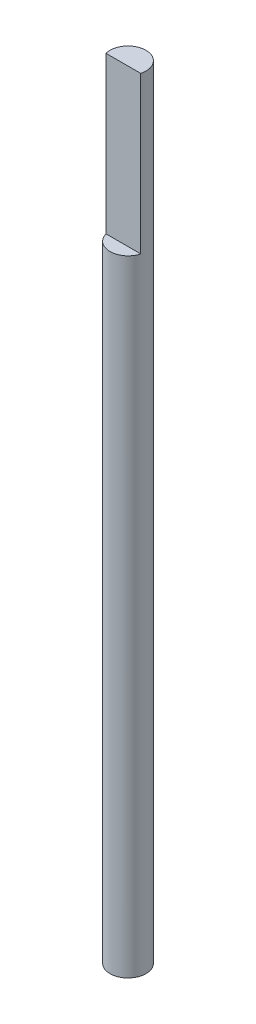
ISO-10303-21;
HEADER;
FILE_DESCRIPTION(('STEP AP214'),'2;1');
FILE_NAME('part.step','',(''),(''),'','','');
FILE_SCHEMA(('AUTOMOTIVE_DESIGN { 1 0 10303 214 1 1 1 1 }'));
ENDSEC;
DATA;
#1=APPLICATION_CONTEXT('core data for automotive mechanical design processes');
#2=APPLICATION_PROTOCOL_DEFINITION('international standard','automotive_design',2000,#1);
#3=PRODUCT_CONTEXT('',#1,'mechanical');
#4=PRODUCT('Part','Part','',(#3));
#5=PRODUCT_RELATED_PRODUCT_CATEGORY('part','',(#4));
#6=PRODUCT_DEFINITION_FORMATION('','',#4);
#7=PRODUCT_DEFINITION_CONTEXT('part definition',#1,'design');
#8=PRODUCT_DEFINITION('design','',#6,#7);
#9=PRODUCT_DEFINITION_SHAPE('','',#8);
#10=(LENGTH_UNIT() NAMED_UNIT(*) SI_UNIT(.MILLI.,.METRE.));
#11=(NAMED_UNIT(*) PLANE_ANGLE_UNIT() SI_UNIT($,.RADIAN.));
#12=(NAMED_UNIT(*) SI_UNIT($,.STERADIAN.) SOLID_ANGLE_UNIT());
#13=UNCERTAINTY_MEASURE_WITH_UNIT(LENGTH_MEASURE(1.E-05),#10,'distance_accuracy_value','');
#14=(GEOMETRIC_REPRESENTATION_CONTEXT(3) GLOBAL_UNCERTAINTY_ASSIGNED_CONTEXT((#13)) GLOBAL_UNIT_ASSIGNED_CONTEXT((#10,
#11,#12)) REPRESENTATION_CONTEXT('',''));
#15=CARTESIAN_POINT('',(0.,0.,0.));
#16=DIRECTION('',(0.,0.,1.));
#17=DIRECTION('',(1.,0.,0.));
#18=AXIS2_PLACEMENT_3D('',#15,#16,#17);
#19=CARTESIAN_POINT('',(0.,127.,0.));
#20=DIRECTION('',(0.,-1.,0.));
#21=DIRECTION('',(0.,0.,-1.));
#22=AXIS2_PLACEMENT_3D('',#19,#20,#21);
#23=CYLINDRICAL_SURFACE('',#22,2.921);
#24=CARTESIAN_POINT('',(0.,127.,0.));
#25=DIRECTION('',(0.,1.,0.));
#26=DIRECTION('',(0.,0.,1.));
#27=AXIS2_PLACEMENT_3D('',#24,#25,#26);
#28=CIRCLE('',#27,2.921);
#29=CARTESIAN_POINT('',(2.82198479502472,127.,0.754084091232057));
#30=VERTEX_POINT('',#29);
#31=CARTESIAN_POINT('',(-2.82198479502472,127.,0.754084091232057));
#32=VERTEX_POINT('',#31);
#33=EDGE_CURVE('E70',#30,#32,#28,.T.);
#34=ORIENTED_EDGE('',*,*,#33,.F.);
#35=DIRECTION('',(0.,-1.,0.));
#36=VECTOR('',#35,1.);
#37=CARTESIAN_POINT('',(2.82198479502472,127.,0.754084091232057));
#38=LINE('',#37,#36);
#39=CARTESIAN_POINT('',(2.82198479502472,101.6,0.754084091232057));
#40=VERTEX_POINT('',#39);
#41=EDGE_CURVE('E53',#30,#40,#38,.T.);
#42=ORIENTED_EDGE('',*,*,#41,.T.);
#43=CARTESIAN_POINT('',(0.,101.6,0.));
#44=DIRECTION('',(0.,1.,0.));
#45=DIRECTION('',(0.,0.,1.));
#46=AXIS2_PLACEMENT_3D('',#43,#44,#45);
#47=CIRCLE('',#46,2.921);
#48=CARTESIAN_POINT('',(-2.82198479502472,101.6,0.754084091232057));
#49=VERTEX_POINT('',#48);
#50=EDGE_CURVE('E11',#49,#40,#47,.T.);
#51=ORIENTED_EDGE('',*,*,#50,.F.);
#52=DIRECTION('',(0.,1.,0.));
#53=VECTOR('',#52,1.);
#54=CARTESIAN_POINT('',(-2.82198479502472,101.6,0.754084091232057));
#55=LINE('',#54,#53);
#56=EDGE_CURVE('E65',#49,#32,#55,.T.);
#57=ORIENTED_EDGE('',*,*,#56,.T.);
#58=EDGE_LOOP('',(#34,#42,#51,#57));
#59=FACE_BOUND('',#58,.T.);
#60=CARTESIAN_POINT('',(0.,0.,0.));
#61=DIRECTION('',(0.,1.,0.));
#62=DIRECTION('',(0.,0.,1.));
#63=AXIS2_PLACEMENT_3D('',#60,#61,#62);
#64=CIRCLE('',#63,2.921);
#65=CARTESIAN_POINT('',(0.,0.,2.921));
#66=VERTEX_POINT('',#65);
#67=EDGE_CURVE('E78',#66,#66,#64,.T.);
#68=ORIENTED_EDGE('',*,*,#67,.T.);
#69=EDGE_LOOP('',(#68));
#70=FACE_BOUND('',#69,.T.);
#71=ADVANCED_FACE('F38',(#59,#70),#23,.T.);
#72=CARTESIAN_POINT('',(0.,127.,0.));
#73=DIRECTION('',(0.,1.,0.));
#74=DIRECTION('',(0.,0.,1.));
#75=AXIS2_PLACEMENT_3D('',#72,#73,#74);
#76=PLANE('',#75);
#77=DIRECTION('',(-1.,0.,0.));
#78=VECTOR('',#77,1.);
#79=CARTESIAN_POINT('',(0.,127.,0.754084091232057));
#80=LINE('',#79,#78);
#81=EDGE_CURVE('E46',#30,#32,#80,.T.);
#82=ORIENTED_EDGE('',*,*,#81,.F.);
#83=ORIENTED_EDGE('',*,*,#33,.T.);
#84=EDGE_LOOP('',(#82,#83));
#85=FACE_BOUND('',#84,.T.);
#86=ADVANCED_FACE('F76',(#85),#76,.T.);
#87=CARTESIAN_POINT('',(0.,0.,0.));
#88=DIRECTION('',(0.,1.,0.));
#89=DIRECTION('',(0.,0.,1.));
#90=AXIS2_PLACEMENT_3D('',#87,#88,#89);
#91=PLANE('',#90);
#92=ORIENTED_EDGE('',*,*,#67,.F.);
#93=EDGE_LOOP('',(#92));
#94=FACE_BOUND('',#93,.T.);
#95=ADVANCED_FACE('F89',(#94),#91,.F.);
#96=CARTESIAN_POINT('',(0.,101.6,0.));
#97=DIRECTION('',(0.,1.,0.));
#98=DIRECTION('',(0.,0.,1.));
#99=AXIS2_PLACEMENT_3D('',#96,#97,#98);
#100=PLANE('',#99);
#101=ORIENTED_EDGE('',*,*,#50,.T.);
#102=DIRECTION('',(-1.,0.,0.));
#103=VECTOR('',#102,1.);
#104=CARTESIAN_POINT('',(-2.82198479502472,101.6,0.754084091232057));
#105=LINE('',#104,#103);
#106=EDGE_CURVE('E74',#40,#49,#105,.T.);
#107=ORIENTED_EDGE('',*,*,#106,.T.);
#108=EDGE_LOOP('',(#101,#107));
#109=FACE_BOUND('',#108,.T.);
#110=ADVANCED_FACE('F87',(#109),#100,.T.);
#111=CARTESIAN_POINT('',(-2.82198479502472,101.6,0.754084091232057));
#112=DIRECTION('',(0.,0.,-1.));
#113=DIRECTION('',(-1.,0.,0.));
#114=AXIS2_PLACEMENT_3D('',#111,#112,#113);
#115=PLANE('',#114);
#116=ORIENTED_EDGE('',*,*,#81,.T.);
#117=ORIENTED_EDGE('',*,*,#56,.F.);
#118=ORIENTED_EDGE('',*,*,#106,.F.);
#119=ORIENTED_EDGE('',*,*,#41,.F.);
#120=EDGE_LOOP('',(#116,#117,#118,#119));
#121=FACE_BOUND('',#120,.T.);
#122=ADVANCED_FACE('F64',(#121),#115,.F.);
#123=CLOSED_SHELL('',(#71,#86,#95,#110,#122));
#124=MANIFOLD_SOLID_BREP('B2',#123);
#125=ADVANCED_BREP_SHAPE_REPRESENTATION('',(#18,#124),#14);
#126=SHAPE_DEFINITION_REPRESENTATION(#9,#125);
ENDSEC;
END-ISO-10303-21;
